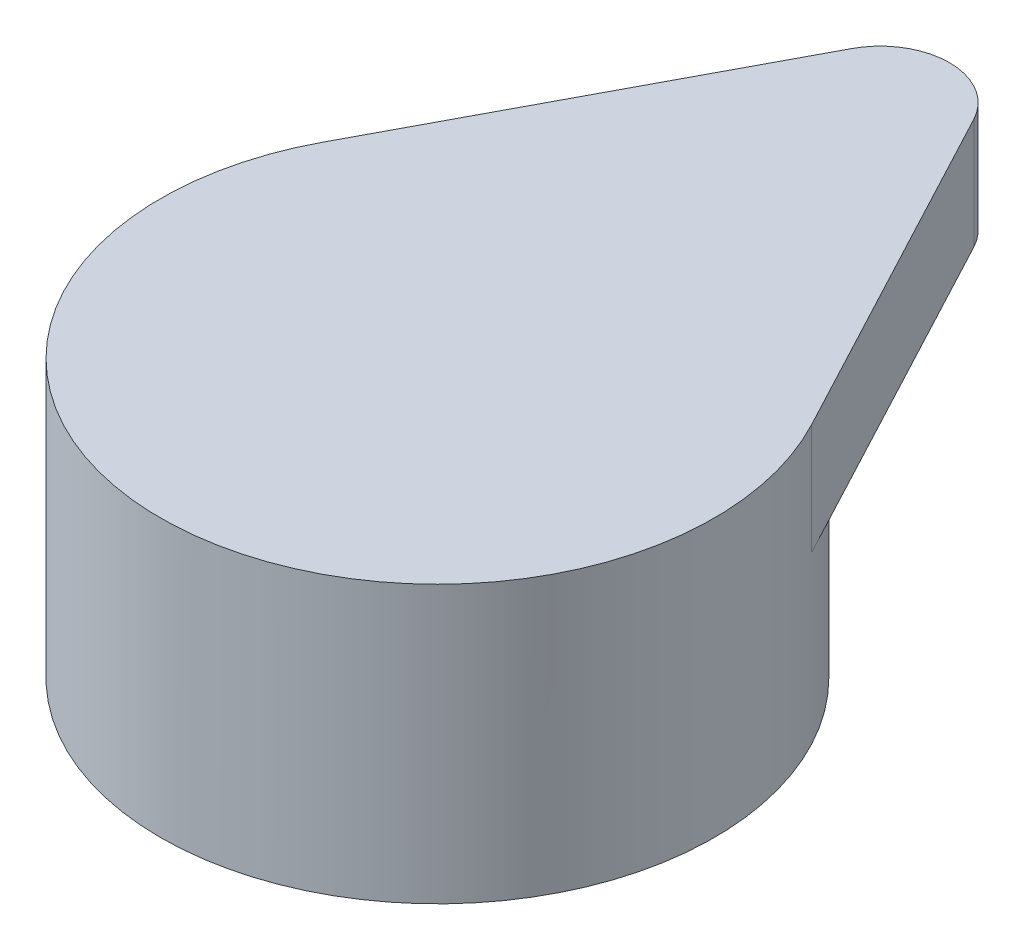
ISO-10303-21;
HEADER;
FILE_DESCRIPTION(('STEP AP214'),'2;1');
FILE_NAME('part.step','',(''),(''),'','','');
FILE_SCHEMA(('AUTOMOTIVE_DESIGN { 1 0 10303 214 1 1 1 1 }'));
ENDSEC;
DATA;
#1=APPLICATION_CONTEXT('core data for automotive mechanical design processes');
#2=APPLICATION_PROTOCOL_DEFINITION('international standard','automotive_design',2000,#1);
#3=PRODUCT_CONTEXT('',#1,'mechanical');
#4=PRODUCT('Part','Part','',(#3));
#5=PRODUCT_RELATED_PRODUCT_CATEGORY('part','',(#4));
#6=PRODUCT_DEFINITION_FORMATION('','',#4);
#7=PRODUCT_DEFINITION_CONTEXT('part definition',#1,'design');
#8=PRODUCT_DEFINITION('design','',#6,#7);
#9=PRODUCT_DEFINITION_SHAPE('','',#8);
#10=(LENGTH_UNIT() NAMED_UNIT(*) SI_UNIT(.MILLI.,.METRE.));
#11=(NAMED_UNIT(*) PLANE_ANGLE_UNIT() SI_UNIT($,.RADIAN.));
#12=(NAMED_UNIT(*) SI_UNIT($,.STERADIAN.) SOLID_ANGLE_UNIT());
#13=UNCERTAINTY_MEASURE_WITH_UNIT(LENGTH_MEASURE(1.E-05),#10,'distance_accuracy_value','');
#14=(GEOMETRIC_REPRESENTATION_CONTEXT(3) GLOBAL_UNCERTAINTY_ASSIGNED_CONTEXT((#13)) GLOBAL_UNIT_ASSIGNED_CONTEXT((#10,
#11,#12)) REPRESENTATION_CONTEXT('',''));
#15=CARTESIAN_POINT('',(0.,0.,0.));
#16=DIRECTION('',(0.,0.,1.));
#17=DIRECTION('',(1.,0.,0.));
#18=AXIS2_PLACEMENT_3D('',#15,#16,#17);
#19=CARTESIAN_POINT('',(0.,0.,0.));
#20=DIRECTION('',(0.,1.,0.));
#21=DIRECTION('',(0.,0.,1.));
#22=AXIS2_PLACEMENT_3D('',#19,#20,#21);
#23=PLANE('',#22);
#24=CARTESIAN_POINT('',(0.,0.,0.));
#25=DIRECTION('',(0.,1.,0.));
#26=DIRECTION('',(0.,0.,1.));
#27=AXIS2_PLACEMENT_3D('',#24,#25,#26);
#28=CIRCLE('',#27,5.00000003300016);
#29=CARTESIAN_POINT('',(0.,0.,5.00000003300016));
#30=VERTEX_POINT('',#29);
#31=EDGE_CURVE('E45',#30,#30,#28,.T.);
#32=ORIENTED_EDGE('',*,*,#31,.F.);
#33=EDGE_LOOP('',(#32));
#34=FACE_BOUND('',#33,.T.);
#35=CARTESIAN_POINT('',(0.,0.,0.));
#36=DIRECTION('',(0.,1.,0.));
#37=DIRECTION('',(0.,0.,1.));
#38=AXIS2_PLACEMENT_3D('',#35,#36,#37);
#39=CIRCLE('',#38,3.);
#40=CARTESIAN_POINT('',(0.,0.,3.));
#41=VERTEX_POINT('',#40);
#42=EDGE_CURVE('E132',#41,#41,#39,.T.);
#43=ORIENTED_EDGE('',*,*,#42,.T.);
#44=EDGE_LOOP('',(#43));
#45=FACE_BOUND('',#44,.T.);
#46=ADVANCED_FACE('F41',(#34,#45),#23,.F.);
#47=CARTESIAN_POINT('',(0.,3.,0.));
#48=DIRECTION('',(0.,-1.,0.));
#49=DIRECTION('',(0.,0.,-1.));
#50=AXIS2_PLACEMENT_3D('',#47,#48,#49);
#51=CYLINDRICAL_SURFACE('',#50,5.00000003300016);
#52=CARTESIAN_POINT('',(0.,3.,0.));
#53=DIRECTION('',(0.,1.,0.));
#54=DIRECTION('',(0.,0.,1.));
#55=AXIS2_PLACEMENT_3D('',#52,#53,#54);
#56=CIRCLE('',#55,5.00000003300016);
#57=CARTESIAN_POINT('',(4.41665441628546,3.,-2.34375000738299));
#58=VERTEX_POINT('',#57);
#59=CARTESIAN_POINT('',(-4.41665441628546,3.,-2.34375000738299));
#60=VERTEX_POINT('',#59);
#61=EDGE_CURVE('E11',#58,#60,#56,.T.);
#62=ORIENTED_EDGE('',*,*,#61,.F.);
#63=DIRECTION('',(0.,-1.,0.));
#64=VECTOR('',#63,1.);
#65=CARTESIAN_POINT('',(4.41665441628546,5.,-2.34375000738299));
#66=LINE('',#65,#64);
#67=CARTESIAN_POINT('',(4.41665441628546,5.,-2.34375000738299));
#68=VERTEX_POINT('',#67);
#69=EDGE_CURVE('E109',#68,#58,#66,.T.);
#70=ORIENTED_EDGE('',*,*,#69,.F.);
#71=CARTESIAN_POINT('',(0.,5.,0.));
#72=DIRECTION('',(0.,1.,0.));
#73=DIRECTION('',(0.,0.,1.));
#74=AXIS2_PLACEMENT_3D('',#71,#72,#73);
#75=CIRCLE('',#74,5.00000003300016);
#76=CARTESIAN_POINT('',(-4.41665441628546,5.,-2.34375000738299));
#77=VERTEX_POINT('',#76);
#78=EDGE_CURVE('E64',#77,#68,#75,.T.);
#79=ORIENTED_EDGE('',*,*,#78,.F.);
#80=DIRECTION('',(0.,-1.,0.));
#81=VECTOR('',#80,1.);
#82=CARTESIAN_POINT('',(-4.41665441628546,5.,-2.34375000738299));
#83=LINE('',#82,#81);
#84=EDGE_CURVE('E103',#77,#60,#83,.T.);
#85=ORIENTED_EDGE('',*,*,#84,.T.);
#86=EDGE_LOOP('',(#62,#70,#79,#85));
#87=FACE_BOUND('',#86,.T.);
#88=ORIENTED_EDGE('',*,*,#31,.T.);
#89=EDGE_LOOP('',(#88));
#90=FACE_BOUND('',#89,.T.);
#91=ADVANCED_FACE('F43',(#87,#90),#51,.T.);
#92=CARTESIAN_POINT('',(0.,3.,0.));
#93=DIRECTION('',(0.,-1.,0.));
#94=DIRECTION('',(0.,0.,-1.));
#95=AXIS2_PLACEMENT_3D('',#92,#93,#94);
#96=CYLINDRICAL_SURFACE('',#95,3.);
#97=CARTESIAN_POINT('',(0.,3.,0.));
#98=DIRECTION('',(0.,1.,0.));
#99=DIRECTION('',(0.,0.,1.));
#100=AXIS2_PLACEMENT_3D('',#97,#98,#99);
#101=CIRCLE('',#100,3.);
#102=CARTESIAN_POINT('',(0.,3.,3.));
#103=VERTEX_POINT('',#102);
#104=EDGE_CURVE('E128',#103,#103,#101,.T.);
#105=ORIENTED_EDGE('',*,*,#104,.T.);
#106=EDGE_LOOP('',(#105));
#107=FACE_BOUND('',#106,.T.);
#108=ORIENTED_EDGE('',*,*,#42,.F.);
#109=EDGE_LOOP('',(#108));
#110=FACE_BOUND('',#109,.T.);
#111=ADVANCED_FACE('F146',(#107,#110),#96,.F.);
#112=CARTESIAN_POINT('',(0.,3.,0.));
#113=DIRECTION('',(0.,1.,0.));
#114=DIRECTION('',(0.,0.,1.));
#115=AXIS2_PLACEMENT_3D('',#112,#113,#114);
#116=PLANE('',#115);
#117=ORIENTED_EDGE('',*,*,#104,.F.);
#118=EDGE_LOOP('',(#117));
#119=FACE_BOUND('',#118,.T.);
#120=ADVANCED_FACE('F150',(#119),#116,.F.);
#121=DIRECTION('',(-0.468749998382833,0.,-0.883330877427079));
#122=VECTOR('',#121,1.);
#123=CARTESIAN_POINT('',(4.41665441628546,3.,-2.34375000738299));
#124=LINE('',#123,#122);
#125=CARTESIAN_POINT('',(1.10416359678385,3.,-8.58593759597854));
#126=VERTEX_POINT('',#125);
#127=EDGE_CURVE('E113',#58,#126,#124,.T.);
#128=ORIENTED_EDGE('',*,*,#127,.F.);
#129=ORIENTED_EDGE('',*,*,#61,.T.);
#130=DIRECTION('',(-0.468749998382833,0.,0.88333087742708));
#131=VECTOR('',#130,1.);
#132=CARTESIAN_POINT('',(-4.41665441628546,3.,-2.34375000738299));
#133=LINE('',#132,#131);
#134=CARTESIAN_POINT('',(-1.10416359678385,3.,-8.58593759597854));
#135=VERTEX_POINT('',#134);
#136=EDGE_CURVE('E119',#135,#60,#133,.T.);
#137=ORIENTED_EDGE('',*,*,#136,.F.);
#138=CARTESIAN_POINT('',(0.,3.,-8.000000098));
#139=DIRECTION('',(0.,1.,0.));
#140=DIRECTION('',(0.,0.,1.));
#141=AXIS2_PLACEMENT_3D('',#138,#139,#140);
#142=CIRCLE('',#141,1.25);
#143=EDGE_CURVE('E99',#126,#135,#142,.T.);
#144=ORIENTED_EDGE('',*,*,#143,.F.);
#145=EDGE_LOOP('',(#128,#129,#137,#144));
#146=FACE_BOUND('',#145,.T.);
#147=ADVANCED_FACE('F155',(#146),#116,.F.);
#148=CARTESIAN_POINT('',(4.41665441628546,5.,-2.34375000738299));
#149=DIRECTION('',(-0.883330877427079,0.,0.468749998382833));
#150=DIRECTION('',(0.468749998382833,0.,0.883330877427079));
#151=AXIS2_PLACEMENT_3D('',#148,#149,#150);
#152=PLANE('',#151);
#153=ORIENTED_EDGE('',*,*,#127,.T.);
#154=DIRECTION('',(0.,-1.,0.));
#155=VECTOR('',#154,1.);
#156=CARTESIAN_POINT('',(1.10416359678385,5.,-8.58593759597854));
#157=LINE('',#156,#155);
#158=CARTESIAN_POINT('',(1.10416359678385,5.,-8.58593759597854));
#159=VERTEX_POINT('',#158);
#160=EDGE_CURVE('E102',#159,#126,#157,.T.);
#161=ORIENTED_EDGE('',*,*,#160,.F.);
#162=DIRECTION('',(-0.468749998382833,0.,-0.883330877427079));
#163=VECTOR('',#162,1.);
#164=CARTESIAN_POINT('',(4.41665441628546,5.,-2.34375000738299));
#165=LINE('',#164,#163);
#166=EDGE_CURVE('E92',#68,#159,#165,.T.);
#167=ORIENTED_EDGE('',*,*,#166,.F.);
#168=ORIENTED_EDGE('',*,*,#69,.T.);
#169=EDGE_LOOP('',(#153,#161,#167,#168));
#170=FACE_BOUND('',#169,.T.);
#171=ADVANCED_FACE('F152',(#170),#152,.F.);
#172=CARTESIAN_POINT('',(0.,5.,-8.000000098));
#173=DIRECTION('',(0.,-1.,0.));
#174=DIRECTION('',(0.,0.,-1.));
#175=AXIS2_PLACEMENT_3D('',#172,#173,#174);
#176=CYLINDRICAL_SURFACE('',#175,1.25);
#177=ORIENTED_EDGE('',*,*,#143,.T.);
#178=DIRECTION('',(0.,-1.,0.));
#179=VECTOR('',#178,1.);
#180=CARTESIAN_POINT('',(-1.10416359678385,5.,-8.58593759597854));
#181=LINE('',#180,#179);
#182=CARTESIAN_POINT('',(-1.10416359678385,5.,-8.58593759597854));
#183=VERTEX_POINT('',#182);
#184=EDGE_CURVE('E97',#183,#135,#181,.T.);
#185=ORIENTED_EDGE('',*,*,#184,.F.);
#186=CARTESIAN_POINT('',(0.,5.,-8.000000098));
#187=DIRECTION('',(0.,1.,0.));
#188=DIRECTION('',(0.,0.,1.));
#189=AXIS2_PLACEMENT_3D('',#186,#187,#188);
#190=CIRCLE('',#189,1.25);
#191=EDGE_CURVE('E86',#159,#183,#190,.T.);
#192=ORIENTED_EDGE('',*,*,#191,.F.);
#193=ORIENTED_EDGE('',*,*,#160,.T.);
#194=EDGE_LOOP('',(#177,#185,#192,#193));
#195=FACE_BOUND('',#194,.T.);
#196=ADVANCED_FACE('F98',(#195),#176,.T.);
#197=CARTESIAN_POINT('',(-4.41665441628546,5.,-2.34375000738299));
#198=DIRECTION('',(0.88333087742708,0.,0.468749998382833));
#199=DIRECTION('',(0.468749998382833,0.,-0.88333087742708));
#200=AXIS2_PLACEMENT_3D('',#197,#198,#199);
#201=PLANE('',#200);
#202=ORIENTED_EDGE('',*,*,#136,.T.);
#203=ORIENTED_EDGE('',*,*,#84,.F.);
#204=DIRECTION('',(-0.468749998382833,0.,0.88333087742708));
#205=VECTOR('',#204,1.);
#206=CARTESIAN_POINT('',(-4.41665441628546,5.,-2.34375000738299));
#207=LINE('',#206,#205);
#208=EDGE_CURVE('E89',#183,#77,#207,.T.);
#209=ORIENTED_EDGE('',*,*,#208,.F.);
#210=ORIENTED_EDGE('',*,*,#184,.T.);
#211=EDGE_LOOP('',(#202,#203,#209,#210));
#212=FACE_BOUND('',#211,.T.);
#213=ADVANCED_FACE('F105',(#212),#201,.F.);
#214=CARTESIAN_POINT('',(0.,5.,0.));
#215=DIRECTION('',(0.,1.,0.));
#216=DIRECTION('',(0.,0.,1.));
#217=AXIS2_PLACEMENT_3D('',#214,#215,#216);
#218=PLANE('',#217);
#219=ORIENTED_EDGE('',*,*,#166,.T.);
#220=ORIENTED_EDGE('',*,*,#191,.T.);
#221=ORIENTED_EDGE('',*,*,#208,.T.);
#222=ORIENTED_EDGE('',*,*,#78,.T.);
#223=EDGE_LOOP('',(#219,#220,#221,#222));
#224=FACE_BOUND('',#223,.T.);
#225=ADVANCED_FACE('F87',(#224),#218,.T.);
#226=CLOSED_SHELL('',(#46,#91,#111,#120,#147,#171,#196,#213,#225));
#227=MANIFOLD_SOLID_BREP('B2',#226);
#228=ADVANCED_BREP_SHAPE_REPRESENTATION('',(#18,#227),#14);
#229=SHAPE_DEFINITION_REPRESENTATION(#9,#228);
ENDSEC;
END-ISO-10303-21;
